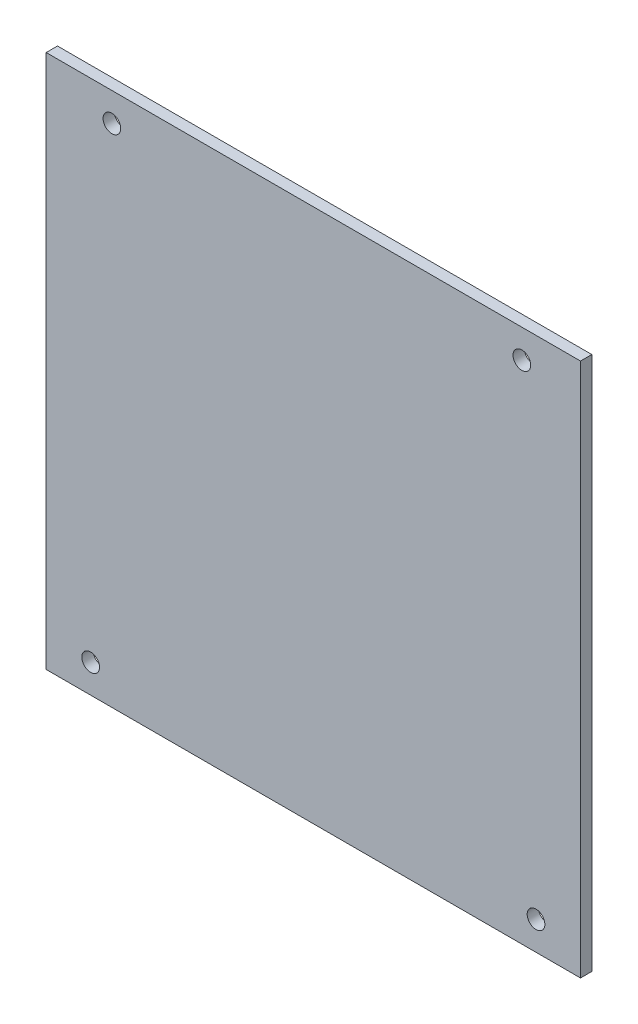
ISO-10303-21;
HEADER;
FILE_DESCRIPTION(('STEP AP214'),'2;1');
FILE_NAME('part.step','',(''),(''),'','','');
FILE_SCHEMA(('AUTOMOTIVE_DESIGN { 1 0 10303 214 1 1 1 1 }'));
ENDSEC;
DATA;
#1=APPLICATION_CONTEXT('core data for automotive mechanical design processes');
#2=APPLICATION_PROTOCOL_DEFINITION('international standard','automotive_design',2000,#1);
#3=PRODUCT_CONTEXT('',#1,'mechanical');
#4=PRODUCT('Part','Part','',(#3));
#5=PRODUCT_RELATED_PRODUCT_CATEGORY('part','',(#4));
#6=PRODUCT_DEFINITION_FORMATION('','',#4);
#7=PRODUCT_DEFINITION_CONTEXT('part definition',#1,'design');
#8=PRODUCT_DEFINITION('design','',#6,#7);
#9=PRODUCT_DEFINITION_SHAPE('','',#8);
#10=(LENGTH_UNIT() NAMED_UNIT(*) SI_UNIT(.MILLI.,.METRE.));
#11=(NAMED_UNIT(*) PLANE_ANGLE_UNIT() SI_UNIT($,.RADIAN.));
#12=(NAMED_UNIT(*) SI_UNIT($,.STERADIAN.) SOLID_ANGLE_UNIT());
#13=UNCERTAINTY_MEASURE_WITH_UNIT(LENGTH_MEASURE(1.E-05),#10,'distance_accuracy_value','');
#14=(GEOMETRIC_REPRESENTATION_CONTEXT(3) GLOBAL_UNCERTAINTY_ASSIGNED_CONTEXT((#13)) GLOBAL_UNIT_ASSIGNED_CONTEXT((#10,
#11,#12)) REPRESENTATION_CONTEXT('',''));
#15=CARTESIAN_POINT('',(0.,0.,0.));
#16=DIRECTION('',(0.,0.,1.));
#17=DIRECTION('',(1.,0.,0.));
#18=AXIS2_PLACEMENT_3D('',#15,#16,#17);
#19=CARTESIAN_POINT('',(0.,0.,1.016));
#20=DIRECTION('',(0.,0.,-1.));
#21=DIRECTION('',(-1.,0.,0.));
#22=AXIS2_PLACEMENT_3D('',#19,#20,#21);
#23=PLANE('',#22);
#24=DIRECTION('',(0.,1.,0.));
#25=VECTOR('',#24,1.);
#26=CARTESIAN_POINT('',(48.,-48.,1.016));
#27=LINE('',#26,#25);
#28=CARTESIAN_POINT('',(48.,-48.,1.016));
#29=VERTEX_POINT('',#28);
#30=CARTESIAN_POINT('',(48.,48.,1.016));
#31=VERTEX_POINT('',#30);
#32=EDGE_CURVE('E89',#29,#31,#27,.T.);
#33=ORIENTED_EDGE('',*,*,#32,.T.);
#34=DIRECTION('',(-1.,0.,0.));
#35=VECTOR('',#34,1.);
#36=CARTESIAN_POINT('',(-48.,48.,1.016));
#37=LINE('',#36,#35);
#38=CARTESIAN_POINT('',(-48.,48.,1.016));
#39=VERTEX_POINT('',#38);
#40=EDGE_CURVE('E84',#31,#39,#37,.T.);
#41=ORIENTED_EDGE('',*,*,#40,.T.);
#42=DIRECTION('',(0.,-1.,0.));
#43=VECTOR('',#42,1.);
#44=CARTESIAN_POINT('',(-48.,-48.,1.016));
#45=LINE('',#44,#43);
#46=CARTESIAN_POINT('',(-48.,-48.,1.016));
#47=VERTEX_POINT('',#46);
#48=EDGE_CURVE('E87',#39,#47,#45,.T.);
#49=ORIENTED_EDGE('',*,*,#48,.T.);
#50=DIRECTION('',(1.,0.,0.));
#51=VECTOR('',#50,1.);
#52=CARTESIAN_POINT('',(-48.,-48.,1.016));
#53=LINE('',#52,#51);
#54=EDGE_CURVE('E54',#47,#29,#53,.T.);
#55=ORIENTED_EDGE('',*,*,#54,.T.);
#56=EDGE_LOOP('',(#33,#41,#49,#55));
#57=FACE_BOUND('',#56,.T.);
#58=CARTESIAN_POINT('',(40.005,-42.865,1.016));
#59=DIRECTION('',(0.,0.,1.));
#60=DIRECTION('',(1.,0.,0.));
#61=AXIS2_PLACEMENT_3D('',#58,#59,#60);
#62=CIRCLE('',#61,1.59);
#63=CARTESIAN_POINT('',(41.595,-42.865,1.016));
#64=VERTEX_POINT('',#63);
#65=EDGE_CURVE('E104',#64,#64,#62,.T.);
#66=ORIENTED_EDGE('',*,*,#65,.F.);
#67=EDGE_LOOP('',(#66));
#68=FACE_BOUND('',#67,.T.);
#69=CARTESIAN_POINT('',(37.465,42.865,1.016));
#70=DIRECTION('',(0.,0.,1.));
#71=DIRECTION('',(1.,0.,0.));
#72=AXIS2_PLACEMENT_3D('',#69,#70,#71);
#73=CIRCLE('',#72,1.59);
#74=CARTESIAN_POINT('',(39.055,42.865,1.016));
#75=VERTEX_POINT('',#74);
#76=EDGE_CURVE('E119',#75,#75,#73,.T.);
#77=ORIENTED_EDGE('',*,*,#76,.F.);
#78=EDGE_LOOP('',(#77));
#79=FACE_BOUND('',#78,.T.);
#80=CARTESIAN_POINT('',(-36.195,42.865,1.016));
#81=DIRECTION('',(0.,0.,1.));
#82=DIRECTION('',(1.,0.,0.));
#83=AXIS2_PLACEMENT_3D('',#80,#81,#82);
#84=CIRCLE('',#83,1.59);
#85=CARTESIAN_POINT('',(-34.605,42.865,1.016));
#86=VERTEX_POINT('',#85);
#87=EDGE_CURVE('E125',#86,#86,#84,.T.);
#88=ORIENTED_EDGE('',*,*,#87,.F.);
#89=EDGE_LOOP('',(#88));
#90=FACE_BOUND('',#89,.T.);
#91=CARTESIAN_POINT('',(-40.005,-42.865,1.016));
#92=DIRECTION('',(0.,0.,1.));
#93=DIRECTION('',(1.,0.,0.));
#94=AXIS2_PLACEMENT_3D('',#91,#92,#93);
#95=CIRCLE('',#94,1.59);
#96=CARTESIAN_POINT('',(-38.415,-42.865,1.016));
#97=VERTEX_POINT('',#96);
#98=EDGE_CURVE('E131',#97,#97,#95,.T.);
#99=ORIENTED_EDGE('',*,*,#98,.F.);
#100=EDGE_LOOP('',(#99));
#101=FACE_BOUND('',#100,.T.);
#102=ADVANCED_FACE('F37',(#57,#68,#79,#90,#101),#23,.F.);
#103=CARTESIAN_POINT('',(0.,0.,-1.016));
#104=DIRECTION('',(0.,0.,-1.));
#105=DIRECTION('',(-1.,0.,0.));
#106=AXIS2_PLACEMENT_3D('',#103,#104,#105);
#107=PLANE('',#106);
#108=CARTESIAN_POINT('',(-36.195,42.865,-1.016));
#109=DIRECTION('',(0.,0.,1.));
#110=DIRECTION('',(1.,0.,0.));
#111=AXIS2_PLACEMENT_3D('',#108,#109,#110);
#112=CIRCLE('',#111,1.59);
#113=CARTESIAN_POINT('',(-34.605,42.865,-1.016));
#114=VERTEX_POINT('',#113);
#115=EDGE_CURVE('E128',#114,#114,#112,.T.);
#116=ORIENTED_EDGE('',*,*,#115,.T.);
#117=EDGE_LOOP('',(#116));
#118=FACE_BOUND('',#117,.T.);
#119=CARTESIAN_POINT('',(40.005,-42.865,-1.016));
#120=DIRECTION('',(0.,0.,1.));
#121=DIRECTION('',(1.,0.,0.));
#122=AXIS2_PLACEMENT_3D('',#119,#120,#121);
#123=CIRCLE('',#122,1.59);
#124=CARTESIAN_POINT('',(41.595,-42.865,-1.016));
#125=VERTEX_POINT('',#124);
#126=EDGE_CURVE('E116',#125,#125,#123,.T.);
#127=ORIENTED_EDGE('',*,*,#126,.T.);
#128=EDGE_LOOP('',(#127));
#129=FACE_BOUND('',#128,.T.);
#130=DIRECTION('',(0.,1.,0.));
#131=VECTOR('',#130,1.);
#132=CARTESIAN_POINT('',(48.,-48.,-1.016));
#133=LINE('',#132,#131);
#134=CARTESIAN_POINT('',(48.,-48.,-1.016));
#135=VERTEX_POINT('',#134);
#136=CARTESIAN_POINT('',(48.,48.,-1.016));
#137=VERTEX_POINT('',#136);
#138=EDGE_CURVE('E101',#135,#137,#133,.T.);
#139=ORIENTED_EDGE('',*,*,#138,.F.);
#140=DIRECTION('',(1.,0.,0.));
#141=VECTOR('',#140,1.);
#142=CARTESIAN_POINT('',(-48.,-48.,-1.016));
#143=LINE('',#142,#141);
#144=CARTESIAN_POINT('',(-48.,-48.,-1.016));
#145=VERTEX_POINT('',#144);
#146=EDGE_CURVE('E77',#145,#135,#143,.T.);
#147=ORIENTED_EDGE('',*,*,#146,.F.);
#148=DIRECTION('',(0.,-1.,0.));
#149=VECTOR('',#148,1.);
#150=CARTESIAN_POINT('',(-48.,-48.,-1.016));
#151=LINE('',#150,#149);
#152=CARTESIAN_POINT('',(-48.,48.,-1.016));
#153=VERTEX_POINT('',#152);
#154=EDGE_CURVE('E71',#153,#145,#151,.T.);
#155=ORIENTED_EDGE('',*,*,#154,.F.);
#156=DIRECTION('',(-1.,0.,0.));
#157=VECTOR('',#156,1.);
#158=CARTESIAN_POINT('',(-48.,48.,-1.016));
#159=LINE('',#158,#157);
#160=EDGE_CURVE('E93',#137,#153,#159,.T.);
#161=ORIENTED_EDGE('',*,*,#160,.F.);
#162=EDGE_LOOP('',(#139,#147,#155,#161));
#163=FACE_BOUND('',#162,.T.);
#164=CARTESIAN_POINT('',(37.465,42.865,-1.016));
#165=DIRECTION('',(0.,0.,1.));
#166=DIRECTION('',(1.,0.,0.));
#167=AXIS2_PLACEMENT_3D('',#164,#165,#166);
#168=CIRCLE('',#167,1.59);
#169=CARTESIAN_POINT('',(39.055,42.865,-1.016));
#170=VERTEX_POINT('',#169);
#171=EDGE_CURVE('E122',#170,#170,#168,.T.);
#172=ORIENTED_EDGE('',*,*,#171,.T.);
#173=EDGE_LOOP('',(#172));
#174=FACE_BOUND('',#173,.T.);
#175=CARTESIAN_POINT('',(-40.005,-42.865,-1.016));
#176=DIRECTION('',(0.,0.,1.));
#177=DIRECTION('',(1.,0.,0.));
#178=AXIS2_PLACEMENT_3D('',#175,#176,#177);
#179=CIRCLE('',#178,1.59);
#180=CARTESIAN_POINT('',(-38.415,-42.865,-1.016));
#181=VERTEX_POINT('',#180);
#182=EDGE_CURVE('E134',#181,#181,#179,.T.);
#183=ORIENTED_EDGE('',*,*,#182,.T.);
#184=EDGE_LOOP('',(#183));
#185=FACE_BOUND('',#184,.T.);
#186=ADVANCED_FACE('F112',(#118,#129,#163,#174,#185),#107,.T.);
#187=CARTESIAN_POINT('',(48.,-48.,1.016));
#188=DIRECTION('',(-1.,0.,0.));
#189=DIRECTION('',(0.,0.,1.));
#190=AXIS2_PLACEMENT_3D('',#187,#188,#189);
#191=PLANE('',#190);
#192=ORIENTED_EDGE('',*,*,#138,.T.);
#193=DIRECTION('',(0.,0.,-1.));
#194=VECTOR('',#193,1.);
#195=CARTESIAN_POINT('',(48.,48.,1.016));
#196=LINE('',#195,#194);
#197=EDGE_CURVE('E11',#31,#137,#196,.T.);
#198=ORIENTED_EDGE('',*,*,#197,.F.);
#199=ORIENTED_EDGE('',*,*,#32,.F.);
#200=DIRECTION('',(0.,0.,-1.));
#201=VECTOR('',#200,1.);
#202=CARTESIAN_POINT('',(48.,-48.,1.016));
#203=LINE('',#202,#201);
#204=EDGE_CURVE('E97',#29,#135,#203,.T.);
#205=ORIENTED_EDGE('',*,*,#204,.T.);
#206=EDGE_LOOP('',(#192,#198,#199,#205));
#207=FACE_BOUND('',#206,.T.);
#208=ADVANCED_FACE('F39',(#207),#191,.F.);
#209=CARTESIAN_POINT('',(-48.,48.,1.016));
#210=DIRECTION('',(0.,-1.,0.));
#211=DIRECTION('',(0.,0.,-1.));
#212=AXIS2_PLACEMENT_3D('',#209,#210,#211);
#213=PLANE('',#212);
#214=ORIENTED_EDGE('',*,*,#160,.T.);
#215=DIRECTION('',(0.,0.,-1.));
#216=VECTOR('',#215,1.);
#217=CARTESIAN_POINT('',(-48.,48.,1.016));
#218=LINE('',#217,#216);
#219=EDGE_CURVE('E46',#39,#153,#218,.T.);
#220=ORIENTED_EDGE('',*,*,#219,.F.);
#221=ORIENTED_EDGE('',*,*,#40,.F.);
#222=ORIENTED_EDGE('',*,*,#197,.T.);
#223=EDGE_LOOP('',(#214,#220,#221,#222));
#224=FACE_BOUND('',#223,.T.);
#225=ADVANCED_FACE('F92',(#224),#213,.F.);
#226=CARTESIAN_POINT('',(-48.,-48.,1.016));
#227=DIRECTION('',(1.,0.,0.));
#228=DIRECTION('',(0.,0.,-1.));
#229=AXIS2_PLACEMENT_3D('',#226,#227,#228);
#230=PLANE('',#229);
#231=ORIENTED_EDGE('',*,*,#154,.T.);
#232=DIRECTION('',(0.,0.,-1.));
#233=VECTOR('',#232,1.);
#234=CARTESIAN_POINT('',(-48.,-48.,1.016));
#235=LINE('',#234,#233);
#236=EDGE_CURVE('E94',#47,#145,#235,.T.);
#237=ORIENTED_EDGE('',*,*,#236,.F.);
#238=ORIENTED_EDGE('',*,*,#48,.F.);
#239=ORIENTED_EDGE('',*,*,#219,.T.);
#240=EDGE_LOOP('',(#231,#237,#238,#239));
#241=FACE_BOUND('',#240,.T.);
#242=ADVANCED_FACE('F95',(#241),#230,.F.);
#243=CARTESIAN_POINT('',(-48.,-48.,1.016));
#244=DIRECTION('',(0.,1.,0.));
#245=DIRECTION('',(0.,0.,1.));
#246=AXIS2_PLACEMENT_3D('',#243,#244,#245);
#247=PLANE('',#246);
#248=ORIENTED_EDGE('',*,*,#146,.T.);
#249=ORIENTED_EDGE('',*,*,#204,.F.);
#250=ORIENTED_EDGE('',*,*,#54,.F.);
#251=ORIENTED_EDGE('',*,*,#236,.T.);
#252=EDGE_LOOP('',(#248,#249,#250,#251));
#253=FACE_BOUND('',#252,.T.);
#254=ADVANCED_FACE('F109',(#253),#247,.F.);
#255=CARTESIAN_POINT('',(40.005,-42.865,1.016));
#256=DIRECTION('',(0.,0.,-1.));
#257=DIRECTION('',(-1.,0.,0.));
#258=AXIS2_PLACEMENT_3D('',#255,#256,#257);
#259=CYLINDRICAL_SURFACE('',#258,1.59);
#260=ORIENTED_EDGE('',*,*,#65,.T.);
#261=EDGE_LOOP('',(#260));
#262=FACE_BOUND('',#261,.T.);
#263=ORIENTED_EDGE('',*,*,#126,.F.);
#264=EDGE_LOOP('',(#263));
#265=FACE_BOUND('',#264,.T.);
#266=ADVANCED_FACE('F151',(#262,#265),#259,.F.);
#267=CARTESIAN_POINT('',(37.465,42.865,1.016));
#268=DIRECTION('',(0.,0.,-1.));
#269=DIRECTION('',(-1.,0.,0.));
#270=AXIS2_PLACEMENT_3D('',#267,#268,#269);
#271=CYLINDRICAL_SURFACE('',#270,1.59);
#272=ORIENTED_EDGE('',*,*,#76,.T.);
#273=EDGE_LOOP('',(#272));
#274=FACE_BOUND('',#273,.T.);
#275=ORIENTED_EDGE('',*,*,#171,.F.);
#276=EDGE_LOOP('',(#275));
#277=FACE_BOUND('',#276,.T.);
#278=ADVANCED_FACE('F205',(#274,#277),#271,.F.);
#279=CARTESIAN_POINT('',(-36.195,42.865,1.016));
#280=DIRECTION('',(0.,0.,-1.));
#281=DIRECTION('',(-1.,0.,0.));
#282=AXIS2_PLACEMENT_3D('',#279,#280,#281);
#283=CYLINDRICAL_SURFACE('',#282,1.59);
#284=ORIENTED_EDGE('',*,*,#87,.T.);
#285=EDGE_LOOP('',(#284));
#286=FACE_BOUND('',#285,.T.);
#287=ORIENTED_EDGE('',*,*,#115,.F.);
#288=EDGE_LOOP('',(#287));
#289=FACE_BOUND('',#288,.T.);
#290=ADVANCED_FACE('F214',(#286,#289),#283,.F.);
#291=CARTESIAN_POINT('',(-40.005,-42.865,1.016));
#292=DIRECTION('',(0.,0.,-1.));
#293=DIRECTION('',(-1.,0.,0.));
#294=AXIS2_PLACEMENT_3D('',#291,#292,#293);
#295=CYLINDRICAL_SURFACE('',#294,1.59);
#296=ORIENTED_EDGE('',*,*,#98,.T.);
#297=EDGE_LOOP('',(#296));
#298=FACE_BOUND('',#297,.T.);
#299=ORIENTED_EDGE('',*,*,#182,.F.);
#300=EDGE_LOOP('',(#299));
#301=FACE_BOUND('',#300,.T.);
#302=ADVANCED_FACE('F140',(#298,#301),#295,.F.);
#303=CLOSED_SHELL('',(#102,#186,#208,#225,#242,#254,#266,#278,#290,#302));
#304=MANIFOLD_SOLID_BREP('B2',#303);
#305=ADVANCED_BREP_SHAPE_REPRESENTATION('',(#18,#304),#14);
#306=SHAPE_DEFINITION_REPRESENTATION(#9,#305);
ENDSEC;
END-ISO-10303-21;
